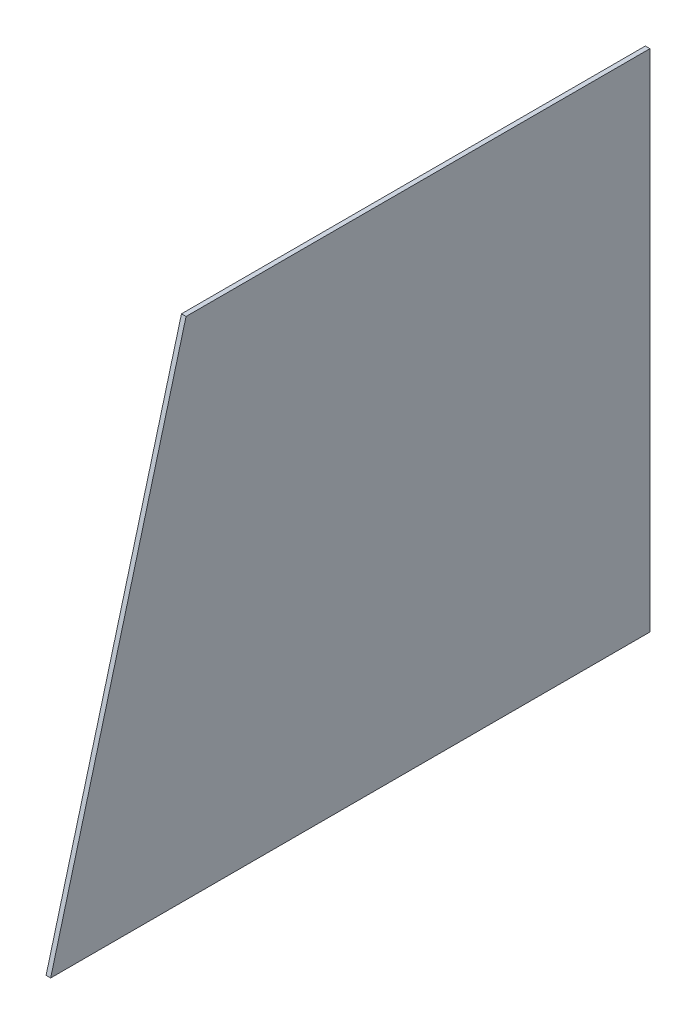
ISO-10303-21;
HEADER;
FILE_DESCRIPTION(('STEP AP214'),'2;1');
FILE_NAME('part.step','',(''),(''),'','','');
FILE_SCHEMA(('AUTOMOTIVE_DESIGN { 1 0 10303 214 1 1 1 1 }'));
ENDSEC;
DATA;
#1=APPLICATION_CONTEXT('core data for automotive mechanical design processes');
#2=APPLICATION_PROTOCOL_DEFINITION('international standard','automotive_design',2000,#1);
#3=PRODUCT_CONTEXT('',#1,'mechanical');
#4=PRODUCT('Part','Part','',(#3));
#5=PRODUCT_RELATED_PRODUCT_CATEGORY('part','',(#4));
#6=PRODUCT_DEFINITION_FORMATION('','',#4);
#7=PRODUCT_DEFINITION_CONTEXT('part definition',#1,'design');
#8=PRODUCT_DEFINITION('design','',#6,#7);
#9=PRODUCT_DEFINITION_SHAPE('','',#8);
#10=(LENGTH_UNIT() NAMED_UNIT(*) SI_UNIT(.MILLI.,.METRE.));
#11=(NAMED_UNIT(*) PLANE_ANGLE_UNIT() SI_UNIT($,.RADIAN.));
#12=(NAMED_UNIT(*) SI_UNIT($,.STERADIAN.) SOLID_ANGLE_UNIT());
#13=UNCERTAINTY_MEASURE_WITH_UNIT(LENGTH_MEASURE(1.E-05),#10,'distance_accuracy_value','');
#14=(GEOMETRIC_REPRESENTATION_CONTEXT(3) GLOBAL_UNCERTAINTY_ASSIGNED_CONTEXT((#13)) GLOBAL_UNIT_ASSIGNED_CONTEXT((#10,
#11,#12)) REPRESENTATION_CONTEXT('',''));
#15=CARTESIAN_POINT('',(0.,0.,0.));
#16=DIRECTION('',(0.,0.,1.));
#17=DIRECTION('',(1.,0.,0.));
#18=AXIS2_PLACEMENT_3D('',#15,#16,#17);
#19=CARTESIAN_POINT('',(3.,-165.327172392147,-196.098076211353));
#20=DIRECTION('',(0.,1.,0.));
#21=DIRECTION('',(0.,0.,1.));
#22=AXIS2_PLACEMENT_3D('',#19,#20,#21);
#23=PLANE('',#22);
#24=DIRECTION('',(0.,0.,-1.));
#25=VECTOR('',#24,1.);
#26=CARTESIAN_POINT('',(0.,-165.327172392147,-196.098076211353));
#27=LINE('',#26,#25);
#28=CARTESIAN_POINT('',(0.,-165.327172392147,196.098076211353));
#29=VERTEX_POINT('',#28);
#30=CARTESIAN_POINT('',(0.,-165.327172392147,-196.098076211353));
#31=VERTEX_POINT('',#30);
#32=EDGE_CURVE('E72',#29,#31,#27,.T.);
#33=ORIENTED_EDGE('',*,*,#32,.T.);
#34=DIRECTION('',(-1.,0.,0.));
#35=VECTOR('',#34,1.);
#36=CARTESIAN_POINT('',(3.,-165.327172392147,-196.098076211353));
#37=LINE('',#36,#35);
#38=CARTESIAN_POINT('',(3.,-165.327172392147,-196.098076211353));
#39=VERTEX_POINT('',#38);
#40=EDGE_CURVE('E11',#39,#31,#37,.T.);
#41=ORIENTED_EDGE('',*,*,#40,.F.);
#42=DIRECTION('',(0.,0.,-1.));
#43=VECTOR('',#42,1.);
#44=CARTESIAN_POINT('',(3.,-165.327172392147,-193.098076211353));
#45=LINE('',#44,#43);
#46=CARTESIAN_POINT('',(3.,-165.327172392147,196.098076211353));
#47=VERTEX_POINT('',#46);
#48=EDGE_CURVE('E77',#47,#39,#45,.T.);
#49=ORIENTED_EDGE('',*,*,#48,.F.);
#50=DIRECTION('',(-1.,0.,0.));
#51=VECTOR('',#50,1.);
#52=CARTESIAN_POINT('',(3.,-165.327172392147,196.098076211353));
#53=LINE('',#52,#51);
#54=EDGE_CURVE('E93',#47,#29,#53,.T.);
#55=ORIENTED_EDGE('',*,*,#54,.T.);
#56=EDGE_LOOP('',(#33,#41,#49,#55));
#57=FACE_BOUND('',#56,.T.);
#58=ADVANCED_FACE('F33',(#57),#23,.F.);
#59=CARTESIAN_POINT('',(3.,165.327172392147,-196.098076211353));
#60=DIRECTION('',(0.,0.,1.));
#61=DIRECTION('',(1.,0.,0.));
#62=AXIS2_PLACEMENT_3D('',#59,#60,#61);
#63=PLANE('',#62);
#64=DIRECTION('',(0.,1.,0.));
#65=VECTOR('',#64,1.);
#66=CARTESIAN_POINT('',(0.,165.327172392147,-196.098076211353));
#67=LINE('',#66,#65);
#68=CARTESIAN_POINT('',(0.,165.327172392147,-196.098076211353));
#69=VERTEX_POINT('',#68);
#70=EDGE_CURVE('E89',#31,#69,#67,.T.);
#71=ORIENTED_EDGE('',*,*,#70,.T.);
#72=DIRECTION('',(-1.,0.,0.));
#73=VECTOR('',#72,1.);
#74=CARTESIAN_POINT('',(3.,165.327172392147,-196.098076211353));
#75=LINE('',#74,#73);
#76=CARTESIAN_POINT('',(3.,165.327172392147,-196.098076211353));
#77=VERTEX_POINT('',#76);
#78=EDGE_CURVE('E41',#77,#69,#75,.T.);
#79=ORIENTED_EDGE('',*,*,#78,.F.);
#80=DIRECTION('',(0.,1.,0.));
#81=VECTOR('',#80,1.);
#82=CARTESIAN_POINT('',(3.,165.327172392147,-196.098076211353));
#83=LINE('',#82,#81);
#84=EDGE_CURVE('E80',#39,#77,#83,.T.);
#85=ORIENTED_EDGE('',*,*,#84,.F.);
#86=ORIENTED_EDGE('',*,*,#40,.T.);
#87=EDGE_LOOP('',(#71,#79,#85,#86));
#88=FACE_BOUND('',#87,.T.);
#89=ADVANCED_FACE('F88',(#88),#63,.F.);
#90=CARTESIAN_POINT('',(3.,165.327172392147,107.499511552558));
#91=DIRECTION('',(0.,-1.,0.));
#92=DIRECTION('',(0.,0.,-1.));
#93=AXIS2_PLACEMENT_3D('',#90,#91,#92);
#94=PLANE('',#93);
#95=DIRECTION('',(0.,0.,1.));
#96=VECTOR('',#95,1.);
#97=CARTESIAN_POINT('',(0.,165.327172392147,107.499511552558));
#98=LINE('',#97,#96);
#99=CARTESIAN_POINT('',(0.,165.327172392147,107.499511552558));
#100=VERTEX_POINT('',#99);
#101=EDGE_CURVE('E65',#69,#100,#98,.T.);
#102=ORIENTED_EDGE('',*,*,#101,.T.);
#103=DIRECTION('',(-1.,0.,0.));
#104=VECTOR('',#103,1.);
#105=CARTESIAN_POINT('',(3.,165.327172392147,107.499511552558));
#106=LINE('',#105,#104);
#107=CARTESIAN_POINT('',(3.,165.327172392147,107.499511552558));
#108=VERTEX_POINT('',#107);
#109=EDGE_CURVE('E90',#108,#100,#106,.T.);
#110=ORIENTED_EDGE('',*,*,#109,.F.);
#111=DIRECTION('',(0.,0.,1.));
#112=VECTOR('',#111,1.);
#113=CARTESIAN_POINT('',(3.,165.327172392147,-193.098076211353));
#114=LINE('',#113,#112);
#115=EDGE_CURVE('E84',#77,#108,#114,.T.);
#116=ORIENTED_EDGE('',*,*,#115,.F.);
#117=ORIENTED_EDGE('',*,*,#78,.T.);
#118=EDGE_LOOP('',(#102,#110,#116,#117));
#119=FACE_BOUND('',#118,.T.);
#120=ADVANCED_FACE('F91',(#119),#94,.F.);
#121=CARTESIAN_POINT('',(3.,-165.327172392147,196.098076211353));
#122=DIRECTION('',(0.,-0.258819045102525,-0.965925826289067));
#123=DIRECTION('',(0.,0.965925826289067,-0.258819045102525));
#124=AXIS2_PLACEMENT_3D('',#121,#122,#123);
#125=PLANE('',#124);
#126=DIRECTION('',(0.,-0.965925826289067,0.258819045102525));
#127=VECTOR('',#126,1.);
#128=CARTESIAN_POINT('',(0.,-165.327172392147,196.098076211353));
#129=LINE('',#128,#127);
#130=EDGE_CURVE('E100',#100,#29,#129,.T.);
#131=ORIENTED_EDGE('',*,*,#130,.T.);
#132=ORIENTED_EDGE('',*,*,#54,.F.);
#133=DIRECTION('',(0.,-0.965925826289067,0.258819045102525));
#134=VECTOR('',#133,1.);
#135=CARTESIAN_POINT('',(3.,-165.327172392147,196.098076211353));
#136=LINE('',#135,#134);
#137=EDGE_CURVE('E49',#108,#47,#136,.T.);
#138=ORIENTED_EDGE('',*,*,#137,.F.);
#139=ORIENTED_EDGE('',*,*,#109,.T.);
#140=EDGE_LOOP('',(#131,#132,#138,#139));
#141=FACE_BOUND('',#140,.T.);
#142=ADVANCED_FACE('F105',(#141),#125,.F.);
#143=CARTESIAN_POINT('',(3.,0.,0.));
#144=DIRECTION('',(1.,0.,0.));
#145=DIRECTION('',(0.,0.,-1.));
#146=AXIS2_PLACEMENT_3D('',#143,#144,#145);
#147=PLANE('',#146);
#148=ORIENTED_EDGE('',*,*,#48,.T.);
#149=ORIENTED_EDGE('',*,*,#84,.T.);
#150=ORIENTED_EDGE('',*,*,#115,.T.);
#151=ORIENTED_EDGE('',*,*,#137,.T.);
#152=EDGE_LOOP('',(#148,#149,#150,#151));
#153=FACE_BOUND('',#152,.T.);
#154=ADVANCED_FACE('F82',(#153),#147,.T.);
#155=CARTESIAN_POINT('',(0.,0.,0.));
#156=DIRECTION('',(1.,0.,0.));
#157=DIRECTION('',(0.,0.,-1.));
#158=AXIS2_PLACEMENT_3D('',#155,#156,#157);
#159=PLANE('',#158);
#160=ORIENTED_EDGE('',*,*,#32,.F.);
#161=ORIENTED_EDGE('',*,*,#130,.F.);
#162=ORIENTED_EDGE('',*,*,#101,.F.);
#163=ORIENTED_EDGE('',*,*,#70,.F.);
#164=EDGE_LOOP('',(#160,#161,#162,#163));
#165=FACE_BOUND('',#164,.T.);
#166=ADVANCED_FACE('F106',(#165),#159,.F.);
#167=CLOSED_SHELL('',(#58,#89,#120,#142,#154,#166));
#168=MANIFOLD_SOLID_BREP('B2',#167);
#169=ADVANCED_BREP_SHAPE_REPRESENTATION('',(#18,#168),#14);
#170=SHAPE_DEFINITION_REPRESENTATION(#9,#169);
ENDSEC;
END-ISO-10303-21;
